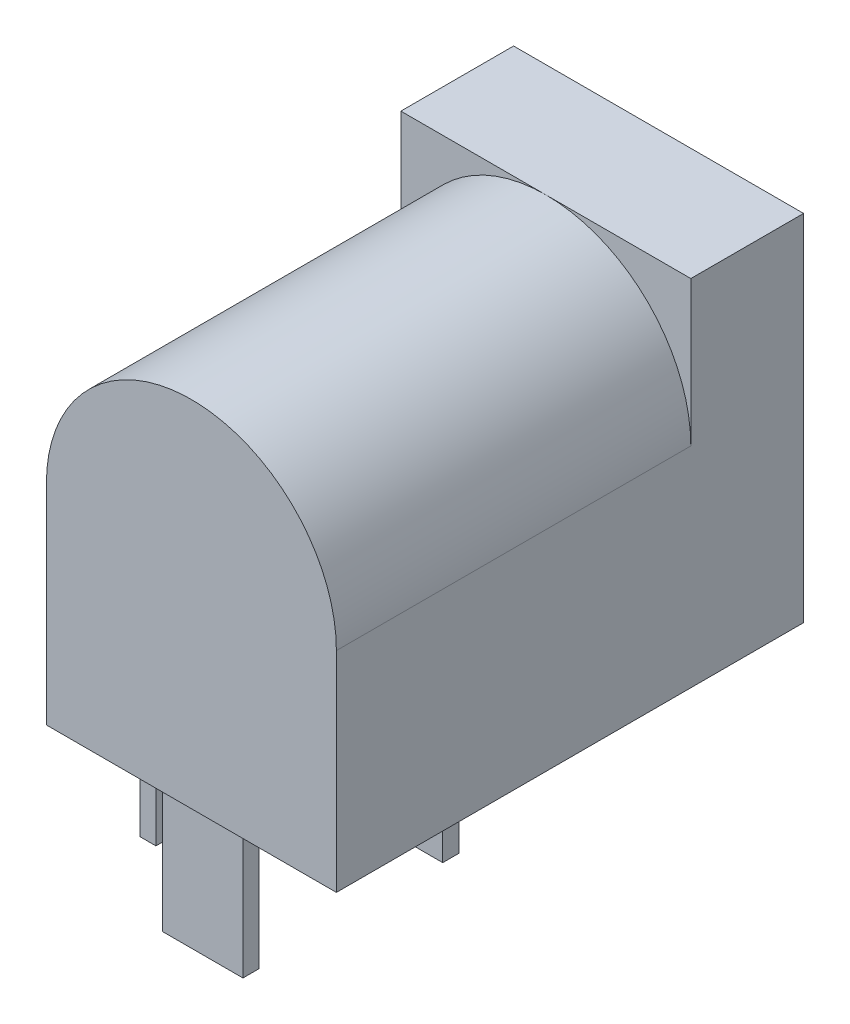
ISO-10303-21;
HEADER;
FILE_DESCRIPTION(('STEP AP214'),'2;1');
FILE_NAME('part.step','',(''),(''),'','','');
FILE_SCHEMA(('AUTOMOTIVE_DESIGN { 1 0 10303 214 1 1 1 1 }'));
ENDSEC;
DATA;
#1=APPLICATION_CONTEXT('core data for automotive mechanical design processes');
#2=APPLICATION_PROTOCOL_DEFINITION('international standard','automotive_design',2000,#1);
#3=PRODUCT_CONTEXT('',#1,'mechanical');
#4=PRODUCT('Part','Part','',(#3));
#5=PRODUCT_RELATED_PRODUCT_CATEGORY('part','',(#4));
#6=PRODUCT_DEFINITION_FORMATION('','',#4);
#7=PRODUCT_DEFINITION_CONTEXT('part definition',#1,'design');
#8=PRODUCT_DEFINITION('design','',#6,#7);
#9=PRODUCT_DEFINITION_SHAPE('','',#8);
#10=(LENGTH_UNIT() NAMED_UNIT(*) SI_UNIT(.MILLI.,.METRE.));
#11=(NAMED_UNIT(*) PLANE_ANGLE_UNIT() SI_UNIT($,.RADIAN.));
#12=(NAMED_UNIT(*) SI_UNIT($,.STERADIAN.) SOLID_ANGLE_UNIT());
#13=UNCERTAINTY_MEASURE_WITH_UNIT(LENGTH_MEASURE(1.E-05),#10,'distance_accuracy_value','');
#14=(GEOMETRIC_REPRESENTATION_CONTEXT(3) GLOBAL_UNCERTAINTY_ASSIGNED_CONTEXT((#13)) GLOBAL_UNIT_ASSIGNED_CONTEXT((#10,
#11,#12)) REPRESENTATION_CONTEXT('',''));
#15=CARTESIAN_POINT('',(0.,0.,0.));
#16=DIRECTION('',(0.,0.,1.));
#17=DIRECTION('',(1.,0.,0.));
#18=AXIS2_PLACEMENT_3D('',#15,#16,#17);
#19=CARTESIAN_POINT('',(-4.5,11.,14.5));
#20=DIRECTION('',(0.,-1.,0.));
#21=DIRECTION('',(1.,0.,0.));
#22=AXIS2_PLACEMENT_3D('',#19,#20,#21);
#23=PLANE('',#22);
#24=DIRECTION('',(-1.,0.,0.));
#25=VECTOR('',#24,1.);
#26=CARTESIAN_POINT('',(-4.5,11.,3.5));
#27=LINE('',#26,#25);
#28=CARTESIAN_POINT('',(4.5,11.,3.5));
#29=VERTEX_POINT('',#28);
#30=CARTESIAN_POINT('',(0.,11.,3.5));
#31=VERTEX_POINT('',#30);
#32=EDGE_CURVE('E11',#29,#31,#27,.T.);
#33=ORIENTED_EDGE('',*,*,#32,.F.);
#34=DIRECTION('',(0.,0.,-1.));
#35=VECTOR('',#34,1.);
#36=CARTESIAN_POINT('',(4.5,11.,14.5));
#37=LINE('',#36,#35);
#38=CARTESIAN_POINT('',(4.5,11.,0.));
#39=VERTEX_POINT('',#38);
#40=EDGE_CURVE('E179',#29,#39,#37,.T.);
#41=ORIENTED_EDGE('',*,*,#40,.T.);
#42=DIRECTION('',(-1.,0.,0.));
#43=VECTOR('',#42,1.);
#44=CARTESIAN_POINT('',(-4.5,11.,0.));
#45=LINE('',#44,#43);
#46=CARTESIAN_POINT('',(-4.5,11.,0.));
#47=VERTEX_POINT('',#46);
#48=EDGE_CURVE('E285',#39,#47,#45,.T.);
#49=ORIENTED_EDGE('',*,*,#48,.T.);
#50=DIRECTION('',(0.,0.,-1.));
#51=VECTOR('',#50,1.);
#52=CARTESIAN_POINT('',(-4.5,11.,14.5));
#53=LINE('',#52,#51);
#54=CARTESIAN_POINT('',(-4.5,11.,3.5));
#55=VERTEX_POINT('',#54);
#56=EDGE_CURVE('E289',#55,#47,#53,.T.);
#57=ORIENTED_EDGE('',*,*,#56,.F.);
#58=EDGE_CURVE('E35',#31,#55,#27,.T.);
#59=ORIENTED_EDGE('',*,*,#58,.F.);
#60=EDGE_LOOP('',(#33,#41,#49,#57,#59));
#61=FACE_BOUND('',#60,.T.);
#62=ADVANCED_FACE('F31',(#61),#23,.F.);
#63=CARTESIAN_POINT('',(-4.5,0.,14.5));
#64=DIRECTION('',(0.,1.,0.));
#65=DIRECTION('',(-1.,0.,0.));
#66=AXIS2_PLACEMENT_3D('',#63,#64,#65);
#67=PLANE('',#66);
#68=DIRECTION('',(0.,0.,-1.));
#69=VECTOR('',#68,1.);
#70=CARTESIAN_POINT('',(-1.25,0.,7.95));
#71=LINE('',#70,#69);
#72=CARTESIAN_POINT('',(-1.25,0.,7.95));
#73=VERTEX_POINT('',#72);
#74=CARTESIAN_POINT('',(-1.25,0.,7.45));
#75=VERTEX_POINT('',#74);
#76=EDGE_CURVE('E215',#73,#75,#71,.T.);
#77=ORIENTED_EDGE('',*,*,#76,.F.);
#78=DIRECTION('',(-1.,0.,0.));
#79=VECTOR('',#78,1.);
#80=CARTESIAN_POINT('',(-1.25,0.,7.95));
#81=LINE('',#80,#79);
#82=CARTESIAN_POINT('',(1.25,0.,7.95));
#83=VERTEX_POINT('',#82);
#84=EDGE_CURVE('E220',#83,#73,#81,.T.);
#85=ORIENTED_EDGE('',*,*,#84,.F.);
#86=DIRECTION('',(0.,0.,1.));
#87=VECTOR('',#86,1.);
#88=CARTESIAN_POINT('',(1.25,0.,7.95));
#89=LINE('',#88,#87);
#90=CARTESIAN_POINT('',(1.25,0.,7.45));
#91=VERTEX_POINT('',#90);
#92=EDGE_CURVE('E232',#91,#83,#89,.T.);
#93=ORIENTED_EDGE('',*,*,#92,.F.);
#94=DIRECTION('',(1.,0.,0.));
#95=VECTOR('',#94,1.);
#96=CARTESIAN_POINT('',(-1.25,0.,7.45));
#97=LINE('',#96,#95);
#98=EDGE_CURVE('E229',#75,#91,#97,.T.);
#99=ORIENTED_EDGE('',*,*,#98,.F.);
#100=EDGE_LOOP('',(#77,#85,#93,#99));
#101=FACE_BOUND('',#100,.T.);
#102=DIRECTION('',(1.,0.,0.));
#103=VECTOR('',#102,1.);
#104=CARTESIAN_POINT('',(-4.5,0.,0.));
#105=LINE('',#104,#103);
#106=CARTESIAN_POINT('',(-4.5,0.,0.));
#107=VERTEX_POINT('',#106);
#108=CARTESIAN_POINT('',(4.5,0.,0.));
#109=VERTEX_POINT('',#108);
#110=EDGE_CURVE('E292',#107,#109,#105,.T.);
#111=ORIENTED_EDGE('',*,*,#110,.T.);
#112=DIRECTION('',(0.,0.,-1.));
#113=VECTOR('',#112,1.);
#114=CARTESIAN_POINT('',(4.5,0.,14.5));
#115=LINE('',#114,#113);
#116=CARTESIAN_POINT('',(4.5,0.,14.5));
#117=VERTEX_POINT('',#116);
#118=EDGE_CURVE('E300',#117,#109,#115,.T.);
#119=ORIENTED_EDGE('',*,*,#118,.F.);
#120=DIRECTION('',(1.,0.,0.));
#121=VECTOR('',#120,1.);
#122=CARTESIAN_POINT('',(-4.5,0.,14.5));
#123=LINE('',#122,#121);
#124=CARTESIAN_POINT('',(-4.5,0.,14.5));
#125=VERTEX_POINT('',#124);
#126=EDGE_CURVE('E284',#125,#117,#123,.T.);
#127=ORIENTED_EDGE('',*,*,#126,.F.);
#128=DIRECTION('',(0.,0.,-1.));
#129=VECTOR('',#128,1.);
#130=CARTESIAN_POINT('',(-4.5,0.,14.5));
#131=LINE('',#130,#129);
#132=EDGE_CURVE('E303',#125,#107,#131,.T.);
#133=ORIENTED_EDGE('',*,*,#132,.T.);
#134=EDGE_LOOP('',(#111,#119,#127,#133));
#135=FACE_BOUND('',#134,.T.);
#136=DIRECTION('',(0.,0.,-1.));
#137=VECTOR('',#136,1.);
#138=CARTESIAN_POINT('',(-1.25,0.,13.65));
#139=LINE('',#138,#137);
#140=CARTESIAN_POINT('',(-1.25,0.,14.15));
#141=VERTEX_POINT('',#140);
#142=CARTESIAN_POINT('',(-1.25,0.,13.65));
#143=VERTEX_POINT('',#142);
#144=EDGE_CURVE('E248',#141,#143,#139,.T.);
#145=ORIENTED_EDGE('',*,*,#144,.F.);
#146=DIRECTION('',(-1.,0.,0.));
#147=VECTOR('',#146,1.);
#148=CARTESIAN_POINT('',(-1.25,0.,14.15));
#149=LINE('',#148,#147);
#150=CARTESIAN_POINT('',(1.25,0.,14.15));
#151=VERTEX_POINT('',#150);
#152=EDGE_CURVE('E253',#151,#141,#149,.T.);
#153=ORIENTED_EDGE('',*,*,#152,.F.);
#154=DIRECTION('',(0.,0.,1.));
#155=VECTOR('',#154,1.);
#156=CARTESIAN_POINT('',(1.25,0.,13.65));
#157=LINE('',#156,#155);
#158=CARTESIAN_POINT('',(1.25,0.,13.65));
#159=VERTEX_POINT('',#158);
#160=EDGE_CURVE('E265',#159,#151,#157,.T.);
#161=ORIENTED_EDGE('',*,*,#160,.F.);
#162=DIRECTION('',(1.,0.,0.));
#163=VECTOR('',#162,1.);
#164=CARTESIAN_POINT('',(-1.25,0.,13.65));
#165=LINE('',#164,#163);
#166=EDGE_CURVE('E262',#143,#159,#165,.T.);
#167=ORIENTED_EDGE('',*,*,#166,.F.);
#168=EDGE_LOOP('',(#145,#153,#161,#167));
#169=FACE_BOUND('',#168,.T.);
#170=DIRECTION('',(0.,0.,-1.));
#171=VECTOR('',#170,1.);
#172=CARTESIAN_POINT('',(-4.15,0.,11.95));
#173=LINE('',#172,#171);
#174=CARTESIAN_POINT('',(-4.15,0.,11.95));
#175=VERTEX_POINT('',#174);
#176=CARTESIAN_POINT('',(-4.15,0.,9.45));
#177=VERTEX_POINT('',#176);
#178=EDGE_CURVE('E182',#175,#177,#173,.T.);
#179=ORIENTED_EDGE('',*,*,#178,.F.);
#180=DIRECTION('',(-1.,0.,0.));
#181=VECTOR('',#180,1.);
#182=CARTESIAN_POINT('',(-4.15,0.,11.95));
#183=LINE('',#182,#181);
#184=CARTESIAN_POINT('',(-3.65,0.,11.95));
#185=VERTEX_POINT('',#184);
#186=EDGE_CURVE('E190',#185,#175,#183,.T.);
#187=ORIENTED_EDGE('',*,*,#186,.F.);
#188=DIRECTION('',(0.,0.,1.));
#189=VECTOR('',#188,1.);
#190=CARTESIAN_POINT('',(-3.65,0.,11.95));
#191=LINE('',#190,#189);
#192=CARTESIAN_POINT('',(-3.65,0.,9.45));
#193=VERTEX_POINT('',#192);
#194=EDGE_CURVE('E200',#193,#185,#191,.T.);
#195=ORIENTED_EDGE('',*,*,#194,.F.);
#196=DIRECTION('',(1.,0.,0.));
#197=VECTOR('',#196,1.);
#198=CARTESIAN_POINT('',(-4.15,0.,9.45));
#199=LINE('',#198,#197);
#200=EDGE_CURVE('E54',#177,#193,#199,.T.);
#201=ORIENTED_EDGE('',*,*,#200,.F.);
#202=EDGE_LOOP('',(#179,#187,#195,#201));
#203=FACE_BOUND('',#202,.T.);
#204=ADVANCED_FACE('F322',(#101,#135,#169,#203),#67,.F.);
#205=CARTESIAN_POINT('',(-4.5,0.,14.5));
#206=DIRECTION('',(1.,0.,0.));
#207=DIRECTION('',(0.,0.,-1.));
#208=AXIS2_PLACEMENT_3D('',#205,#206,#207);
#209=PLANE('',#208);
#210=DIRECTION('',(0.,-1.,0.));
#211=VECTOR('',#210,1.);
#212=CARTESIAN_POINT('',(-4.5,0.,14.5));
#213=LINE('',#212,#211);
#214=CARTESIAN_POINT('',(-4.5,6.5,14.5));
#215=VERTEX_POINT('',#214);
#216=EDGE_CURVE('E282',#215,#125,#213,.T.);
#217=ORIENTED_EDGE('',*,*,#216,.F.);
#218=DIRECTION('',(0.,0.,1.));
#219=VECTOR('',#218,1.);
#220=CARTESIAN_POINT('',(-4.5,6.5,3.5));
#221=LINE('',#220,#219);
#222=CARTESIAN_POINT('',(-4.5,6.5,3.5));
#223=VERTEX_POINT('',#222);
#224=EDGE_CURVE('E174',#223,#215,#221,.T.);
#225=ORIENTED_EDGE('',*,*,#224,.F.);
#226=DIRECTION('',(0.,-1.,0.));
#227=VECTOR('',#226,1.);
#228=CARTESIAN_POINT('',(-4.5,0.,3.5));
#229=LINE('',#228,#227);
#230=EDGE_CURVE('E180',#55,#223,#229,.T.);
#231=ORIENTED_EDGE('',*,*,#230,.F.);
#232=ORIENTED_EDGE('',*,*,#56,.T.);
#233=DIRECTION('',(0.,-1.,0.));
#234=VECTOR('',#233,1.);
#235=CARTESIAN_POINT('',(-4.5,0.,0.));
#236=LINE('',#235,#234);
#237=EDGE_CURVE('E281',#47,#107,#236,.T.);
#238=ORIENTED_EDGE('',*,*,#237,.T.);
#239=ORIENTED_EDGE('',*,*,#132,.F.);
#240=EDGE_LOOP('',(#217,#225,#231,#232,#238,#239));
#241=FACE_BOUND('',#240,.T.);
#242=ADVANCED_FACE('F33',(#241),#209,.F.);
#243=CARTESIAN_POINT('',(4.5,0.,14.5));
#244=DIRECTION('',(-1.,0.,0.));
#245=DIRECTION('',(0.,-1.,0.));
#246=AXIS2_PLACEMENT_3D('',#243,#244,#245);
#247=PLANE('',#246);
#248=DIRECTION('',(0.,1.,0.));
#249=VECTOR('',#248,1.);
#250=CARTESIAN_POINT('',(4.5,0.,3.5));
#251=LINE('',#250,#249);
#252=CARTESIAN_POINT('',(4.5,6.5,3.5));
#253=VERTEX_POINT('',#252);
#254=EDGE_CURVE('E161',#253,#29,#251,.T.);
#255=ORIENTED_EDGE('',*,*,#254,.F.);
#256=DIRECTION('',(0.,0.,1.));
#257=VECTOR('',#256,1.);
#258=CARTESIAN_POINT('',(4.5,6.5,3.5));
#259=LINE('',#258,#257);
#260=CARTESIAN_POINT('',(4.5,6.5,14.5));
#261=VERTEX_POINT('',#260);
#262=EDGE_CURVE('E170',#253,#261,#259,.T.);
#263=ORIENTED_EDGE('',*,*,#262,.T.);
#264=DIRECTION('',(0.,1.,0.));
#265=VECTOR('',#264,1.);
#266=CARTESIAN_POINT('',(4.5,0.,14.5));
#267=LINE('',#266,#265);
#268=EDGE_CURVE('E287',#117,#261,#267,.T.);
#269=ORIENTED_EDGE('',*,*,#268,.F.);
#270=ORIENTED_EDGE('',*,*,#118,.T.);
#271=DIRECTION('',(0.,1.,0.));
#272=VECTOR('',#271,1.);
#273=CARTESIAN_POINT('',(4.5,0.,0.));
#274=LINE('',#273,#272);
#275=EDGE_CURVE('E294',#109,#39,#274,.T.);
#276=ORIENTED_EDGE('',*,*,#275,.T.);
#277=ORIENTED_EDGE('',*,*,#40,.F.);
#278=EDGE_LOOP('',(#255,#263,#269,#270,#276,#277));
#279=FACE_BOUND('',#278,.T.);
#280=ADVANCED_FACE('F177',(#279),#247,.F.);
#281=CARTESIAN_POINT('',(-4.5,0.,14.5));
#282=DIRECTION('',(0.,0.,-1.));
#283=DIRECTION('',(-1.,0.,0.));
#284=AXIS2_PLACEMENT_3D('',#281,#282,#283);
#285=PLANE('',#284);
#286=ORIENTED_EDGE('',*,*,#268,.T.);
#287=CARTESIAN_POINT('',(0.,6.5,14.5));
#288=DIRECTION('',(0.,0.,-1.));
#289=DIRECTION('',(-1.,0.,0.));
#290=AXIS2_PLACEMENT_3D('',#287,#288,#289);
#291=CIRCLE('',#290,4.5);
#292=EDGE_CURVE('E46',#261,#215,#291,.F.);
#293=ORIENTED_EDGE('',*,*,#292,.T.);
#294=ORIENTED_EDGE('',*,*,#216,.T.);
#295=ORIENTED_EDGE('',*,*,#126,.T.);
#296=EDGE_LOOP('',(#286,#293,#294,#295));
#297=FACE_BOUND('',#296,.T.);
#298=ADVANCED_FACE('F325',(#297),#285,.F.);
#299=CARTESIAN_POINT('',(-4.5,0.,0.));
#300=DIRECTION('',(0.,0.,-1.));
#301=DIRECTION('',(-1.,0.,0.));
#302=AXIS2_PLACEMENT_3D('',#299,#300,#301);
#303=PLANE('',#302);
#304=CARTESIAN_POINT('',(0.,6.5,0.));
#305=DIRECTION('',(0.,0.,-1.));
#306=DIRECTION('',(-1.,0.,0.));
#307=AXIS2_PLACEMENT_3D('',#304,#305,#306);
#308=CIRCLE('',#307,2.1);
#309=CARTESIAN_POINT('',(-2.1,6.5,0.));
#310=VERTEX_POINT('',#309);
#311=EDGE_CURVE('E541',#310,#310,#308,.T.);
#312=ORIENTED_EDGE('',*,*,#311,.F.);
#313=EDGE_LOOP('',(#312));
#314=FACE_BOUND('',#313,.T.);
#315=ORIENTED_EDGE('',*,*,#237,.F.);
#316=ORIENTED_EDGE('',*,*,#48,.F.);
#317=ORIENTED_EDGE('',*,*,#275,.F.);
#318=ORIENTED_EDGE('',*,*,#110,.F.);
#319=EDGE_LOOP('',(#315,#316,#317,#318));
#320=FACE_BOUND('',#319,.T.);
#321=ADVANCED_FACE('F318',(#314,#320),#303,.T.);
#322=CARTESIAN_POINT('',(-1.25,-4.1,13.65));
#323=DIRECTION('',(1.,0.,0.));
#324=DIRECTION('',(0.,0.,-1.));
#325=AXIS2_PLACEMENT_3D('',#322,#323,#324);
#326=PLANE('',#325);
#327=ORIENTED_EDGE('',*,*,#144,.T.);
#328=DIRECTION('',(0.,1.,0.));
#329=VECTOR('',#328,1.);
#330=CARTESIAN_POINT('',(-1.25,-4.1,13.65));
#331=LINE('',#330,#329);
#332=CARTESIAN_POINT('',(-1.25,-4.1,13.65));
#333=VERTEX_POINT('',#332);
#334=EDGE_CURVE('E278',#333,#143,#331,.T.);
#335=ORIENTED_EDGE('',*,*,#334,.F.);
#336=DIRECTION('',(0.,0.,-1.));
#337=VECTOR('',#336,1.);
#338=CARTESIAN_POINT('',(-1.25,-4.1,13.65));
#339=LINE('',#338,#337);
#340=CARTESIAN_POINT('',(-1.25,-4.1,14.15));
#341=VERTEX_POINT('',#340);
#342=EDGE_CURVE('E249',#341,#333,#339,.T.);
#343=ORIENTED_EDGE('',*,*,#342,.F.);
#344=DIRECTION('',(0.,1.,0.));
#345=VECTOR('',#344,1.);
#346=CARTESIAN_POINT('',(-1.25,-4.1,14.15));
#347=LINE('',#346,#345);
#348=EDGE_CURVE('E259',#341,#141,#347,.T.);
#349=ORIENTED_EDGE('',*,*,#348,.T.);
#350=EDGE_LOOP('',(#327,#335,#343,#349));
#351=FACE_BOUND('',#350,.T.);
#352=ADVANCED_FACE('F332',(#351),#326,.F.);
#353=CARTESIAN_POINT('',(-1.25,-4.1,13.65));
#354=DIRECTION('',(0.,0.,1.));
#355=DIRECTION('',(1.,0.,0.));
#356=AXIS2_PLACEMENT_3D('',#353,#354,#355);
#357=PLANE('',#356);
#358=ORIENTED_EDGE('',*,*,#166,.T.);
#359=DIRECTION('',(0.,1.,0.));
#360=VECTOR('',#359,1.);
#361=CARTESIAN_POINT('',(1.25,-4.1,13.65));
#362=LINE('',#361,#360);
#363=CARTESIAN_POINT('',(1.25,-4.1,13.65));
#364=VERTEX_POINT('',#363);
#365=EDGE_CURVE('E275',#364,#159,#362,.T.);
#366=ORIENTED_EDGE('',*,*,#365,.F.);
#367=DIRECTION('',(1.,0.,0.));
#368=VECTOR('',#367,1.);
#369=CARTESIAN_POINT('',(-1.25,-4.1,13.65));
#370=LINE('',#369,#368);
#371=EDGE_CURVE('E252',#333,#364,#370,.T.);
#372=ORIENTED_EDGE('',*,*,#371,.F.);
#373=ORIENTED_EDGE('',*,*,#334,.T.);
#374=EDGE_LOOP('',(#358,#366,#372,#373));
#375=FACE_BOUND('',#374,.T.);
#376=ADVANCED_FACE('F384',(#375),#357,.F.);
#377=CARTESIAN_POINT('',(1.25,-4.1,13.65));
#378=DIRECTION('',(-1.,0.,0.));
#379=DIRECTION('',(0.,0.,1.));
#380=AXIS2_PLACEMENT_3D('',#377,#378,#379);
#381=PLANE('',#380);
#382=ORIENTED_EDGE('',*,*,#160,.T.);
#383=DIRECTION('',(0.,1.,0.));
#384=VECTOR('',#383,1.);
#385=CARTESIAN_POINT('',(1.25,-4.1,14.15));
#386=LINE('',#385,#384);
#387=CARTESIAN_POINT('',(1.25,-4.1,14.15));
#388=VERTEX_POINT('',#387);
#389=EDGE_CURVE('E272',#388,#151,#386,.T.);
#390=ORIENTED_EDGE('',*,*,#389,.F.);
#391=DIRECTION('',(0.,0.,1.));
#392=VECTOR('',#391,1.);
#393=CARTESIAN_POINT('',(1.25,-4.1,13.65));
#394=LINE('',#393,#392);
#395=EDGE_CURVE('E255',#364,#388,#394,.T.);
#396=ORIENTED_EDGE('',*,*,#395,.F.);
#397=ORIENTED_EDGE('',*,*,#365,.T.);
#398=EDGE_LOOP('',(#382,#390,#396,#397));
#399=FACE_BOUND('',#398,.T.);
#400=ADVANCED_FACE('F380',(#399),#381,.F.);
#401=CARTESIAN_POINT('',(-1.25,-4.1,14.15));
#402=DIRECTION('',(0.,0.,-1.));
#403=DIRECTION('',(-1.,0.,0.));
#404=AXIS2_PLACEMENT_3D('',#401,#402,#403);
#405=PLANE('',#404);
#406=ORIENTED_EDGE('',*,*,#152,.T.);
#407=ORIENTED_EDGE('',*,*,#348,.F.);
#408=DIRECTION('',(-1.,0.,0.));
#409=VECTOR('',#408,1.);
#410=CARTESIAN_POINT('',(-1.25,-4.1,14.15));
#411=LINE('',#410,#409);
#412=EDGE_CURVE('E257',#388,#341,#411,.T.);
#413=ORIENTED_EDGE('',*,*,#412,.F.);
#414=ORIENTED_EDGE('',*,*,#389,.T.);
#415=EDGE_LOOP('',(#406,#407,#413,#414));
#416=FACE_BOUND('',#415,.T.);
#417=ADVANCED_FACE('F376',(#416),#405,.F.);
#418=CARTESIAN_POINT('',(-1.25,-4.1,14.15));
#419=DIRECTION('',(0.,1.,0.));
#420=DIRECTION('',(-1.,0.,0.));
#421=AXIS2_PLACEMENT_3D('',#418,#419,#420);
#422=PLANE('',#421);
#423=ORIENTED_EDGE('',*,*,#342,.T.);
#424=ORIENTED_EDGE('',*,*,#371,.T.);
#425=ORIENTED_EDGE('',*,*,#395,.T.);
#426=ORIENTED_EDGE('',*,*,#412,.T.);
#427=EDGE_LOOP('',(#423,#424,#425,#426));
#428=FACE_BOUND('',#427,.T.);
#429=ADVANCED_FACE('F370',(#428),#422,.F.);
#430=CARTESIAN_POINT('',(-1.25,-4.1,7.95));
#431=DIRECTION('',(1.,0.,0.));
#432=DIRECTION('',(0.,1.,0.));
#433=AXIS2_PLACEMENT_3D('',#430,#431,#432);
#434=PLANE('',#433);
#435=ORIENTED_EDGE('',*,*,#76,.T.);
#436=DIRECTION('',(0.,1.,0.));
#437=VECTOR('',#436,1.);
#438=CARTESIAN_POINT('',(-1.25,-4.1,7.45));
#439=LINE('',#438,#437);
#440=CARTESIAN_POINT('',(-1.25,-4.1,7.45));
#441=VERTEX_POINT('',#440);
#442=EDGE_CURVE('E245',#441,#75,#439,.T.);
#443=ORIENTED_EDGE('',*,*,#442,.F.);
#444=DIRECTION('',(0.,0.,-1.));
#445=VECTOR('',#444,1.);
#446=CARTESIAN_POINT('',(-1.25,-4.1,7.95));
#447=LINE('',#446,#445);
#448=CARTESIAN_POINT('',(-1.25,-4.1,7.95));
#449=VERTEX_POINT('',#448);
#450=EDGE_CURVE('E216',#449,#441,#447,.T.);
#451=ORIENTED_EDGE('',*,*,#450,.F.);
#452=DIRECTION('',(0.,1.,0.));
#453=VECTOR('',#452,1.);
#454=CARTESIAN_POINT('',(-1.25,-4.1,7.95));
#455=LINE('',#454,#453);
#456=EDGE_CURVE('E226',#449,#73,#455,.T.);
#457=ORIENTED_EDGE('',*,*,#456,.T.);
#458=EDGE_LOOP('',(#435,#443,#451,#457));
#459=FACE_BOUND('',#458,.T.);
#460=ADVANCED_FACE('F354',(#459),#434,.F.);
#461=CARTESIAN_POINT('',(-1.25,-4.1,7.45));
#462=DIRECTION('',(0.,0.,1.));
#463=DIRECTION('',(1.,0.,0.));
#464=AXIS2_PLACEMENT_3D('',#461,#462,#463);
#465=PLANE('',#464);
#466=ORIENTED_EDGE('',*,*,#98,.T.);
#467=DIRECTION('',(0.,1.,0.));
#468=VECTOR('',#467,1.);
#469=CARTESIAN_POINT('',(1.25,-4.1,7.45));
#470=LINE('',#469,#468);
#471=CARTESIAN_POINT('',(1.25,-4.1,7.45));
#472=VERTEX_POINT('',#471);
#473=EDGE_CURVE('E242',#472,#91,#470,.T.);
#474=ORIENTED_EDGE('',*,*,#473,.F.);
#475=DIRECTION('',(1.,0.,0.));
#476=VECTOR('',#475,1.);
#477=CARTESIAN_POINT('',(-1.25,-4.1,7.45));
#478=LINE('',#477,#476);
#479=EDGE_CURVE('E219',#441,#472,#478,.T.);
#480=ORIENTED_EDGE('',*,*,#479,.F.);
#481=ORIENTED_EDGE('',*,*,#442,.T.);
#482=EDGE_LOOP('',(#466,#474,#480,#481));
#483=FACE_BOUND('',#482,.T.);
#484=ADVANCED_FACE('F362',(#483),#465,.F.);
#485=CARTESIAN_POINT('',(1.25,-4.1,7.95));
#486=DIRECTION('',(-1.,0.,0.));
#487=DIRECTION('',(0.,-1.,0.));
#488=AXIS2_PLACEMENT_3D('',#485,#486,#487);
#489=PLANE('',#488);
#490=ORIENTED_EDGE('',*,*,#92,.T.);
#491=DIRECTION('',(0.,1.,0.));
#492=VECTOR('',#491,1.);
#493=CARTESIAN_POINT('',(1.25,-4.1,7.95));
#494=LINE('',#493,#492);
#495=CARTESIAN_POINT('',(1.25,-4.1,7.95));
#496=VERTEX_POINT('',#495);
#497=EDGE_CURVE('E239',#496,#83,#494,.T.);
#498=ORIENTED_EDGE('',*,*,#497,.F.);
#499=DIRECTION('',(0.,0.,1.));
#500=VECTOR('',#499,1.);
#501=CARTESIAN_POINT('',(1.25,-4.1,7.95));
#502=LINE('',#501,#500);
#503=EDGE_CURVE('E222',#472,#496,#502,.T.);
#504=ORIENTED_EDGE('',*,*,#503,.F.);
#505=ORIENTED_EDGE('',*,*,#473,.T.);
#506=EDGE_LOOP('',(#490,#498,#504,#505));
#507=FACE_BOUND('',#506,.T.);
#508=ADVANCED_FACE('F360',(#507),#489,.F.);
#509=CARTESIAN_POINT('',(-1.25,-4.1,7.95));
#510=DIRECTION('',(0.,0.,-1.));
#511=DIRECTION('',(-1.,0.,0.));
#512=AXIS2_PLACEMENT_3D('',#509,#510,#511);
#513=PLANE('',#512);
#514=ORIENTED_EDGE('',*,*,#84,.T.);
#515=ORIENTED_EDGE('',*,*,#456,.F.);
#516=DIRECTION('',(-1.,0.,0.));
#517=VECTOR('',#516,1.);
#518=CARTESIAN_POINT('',(-1.25,-4.1,7.95));
#519=LINE('',#518,#517);
#520=EDGE_CURVE('E224',#496,#449,#519,.T.);
#521=ORIENTED_EDGE('',*,*,#520,.F.);
#522=ORIENTED_EDGE('',*,*,#497,.T.);
#523=EDGE_LOOP('',(#514,#515,#521,#522));
#524=FACE_BOUND('',#523,.T.);
#525=ADVANCED_FACE('F350',(#524),#513,.F.);
#526=CARTESIAN_POINT('',(-1.25,-4.1,7.45));
#527=DIRECTION('',(0.,-1.,0.));
#528=DIRECTION('',(1.,0.,0.));
#529=AXIS2_PLACEMENT_3D('',#526,#527,#528);
#530=PLANE('',#529);
#531=ORIENTED_EDGE('',*,*,#450,.T.);
#532=ORIENTED_EDGE('',*,*,#479,.T.);
#533=ORIENTED_EDGE('',*,*,#503,.T.);
#534=ORIENTED_EDGE('',*,*,#520,.T.);
#535=EDGE_LOOP('',(#531,#532,#533,#534));
#536=FACE_BOUND('',#535,.T.);
#537=ADVANCED_FACE('F356',(#536),#530,.T.);
#538=CARTESIAN_POINT('',(-4.15,-4.1,11.95));
#539=DIRECTION('',(1.,0.,0.));
#540=DIRECTION('',(0.,1.,0.));
#541=AXIS2_PLACEMENT_3D('',#538,#539,#540);
#542=PLANE('',#541);
#543=ORIENTED_EDGE('',*,*,#178,.T.);
#544=DIRECTION('',(0.,1.,0.));
#545=VECTOR('',#544,1.);
#546=CARTESIAN_POINT('',(-4.15,-4.1,9.45));
#547=LINE('',#546,#545);
#548=CARTESIAN_POINT('',(-4.15,-4.1,9.45));
#549=VERTEX_POINT('',#548);
#550=EDGE_CURVE('E213',#549,#177,#547,.T.);
#551=ORIENTED_EDGE('',*,*,#550,.F.);
#552=DIRECTION('',(0.,0.,-1.));
#553=VECTOR('',#552,1.);
#554=CARTESIAN_POINT('',(-4.15,-4.1,11.95));
#555=LINE('',#554,#553);
#556=CARTESIAN_POINT('',(-4.15,-4.1,11.95));
#557=VERTEX_POINT('',#556);
#558=EDGE_CURVE('E186',#557,#549,#555,.T.);
#559=ORIENTED_EDGE('',*,*,#558,.F.);
#560=DIRECTION('',(0.,1.,0.));
#561=VECTOR('',#560,1.);
#562=CARTESIAN_POINT('',(-4.15,-4.1,11.95));
#563=LINE('',#562,#561);
#564=EDGE_CURVE('E196',#557,#175,#563,.T.);
#565=ORIENTED_EDGE('',*,*,#564,.T.);
#566=EDGE_LOOP('',(#543,#551,#559,#565));
#567=FACE_BOUND('',#566,.T.);
#568=ADVANCED_FACE('F407',(#567),#542,.F.);
#569=CARTESIAN_POINT('',(-4.15,-4.1,9.45));
#570=DIRECTION('',(0.,0.,1.));
#571=DIRECTION('',(1.,0.,0.));
#572=AXIS2_PLACEMENT_3D('',#569,#570,#571);
#573=PLANE('',#572);
#574=ORIENTED_EDGE('',*,*,#200,.T.);
#575=DIRECTION('',(0.,1.,0.));
#576=VECTOR('',#575,1.);
#577=CARTESIAN_POINT('',(-3.65,-4.1,9.45));
#578=LINE('',#577,#576);
#579=CARTESIAN_POINT('',(-3.65,-4.1,9.45));
#580=VERTEX_POINT('',#579);
#581=EDGE_CURVE('E210',#580,#193,#578,.T.);
#582=ORIENTED_EDGE('',*,*,#581,.F.);
#583=DIRECTION('',(1.,0.,0.));
#584=VECTOR('',#583,1.);
#585=CARTESIAN_POINT('',(-4.15,-4.1,9.45));
#586=LINE('',#585,#584);
#587=EDGE_CURVE('E189',#549,#580,#586,.T.);
#588=ORIENTED_EDGE('',*,*,#587,.F.);
#589=ORIENTED_EDGE('',*,*,#550,.T.);
#590=EDGE_LOOP('',(#574,#582,#588,#589));
#591=FACE_BOUND('',#590,.T.);
#592=ADVANCED_FACE('F415',(#591),#573,.F.);
#593=CARTESIAN_POINT('',(-3.65,-4.1,11.95));
#594=DIRECTION('',(-1.,0.,0.));
#595=DIRECTION('',(0.,-1.,0.));
#596=AXIS2_PLACEMENT_3D('',#593,#594,#595);
#597=PLANE('',#596);
#598=ORIENTED_EDGE('',*,*,#194,.T.);
#599=DIRECTION('',(0.,1.,0.));
#600=VECTOR('',#599,1.);
#601=CARTESIAN_POINT('',(-3.65,-4.1,11.95));
#602=LINE('',#601,#600);
#603=CARTESIAN_POINT('',(-3.65,-4.1,11.95));
#604=VERTEX_POINT('',#603);
#605=EDGE_CURVE('E207',#604,#185,#602,.T.);
#606=ORIENTED_EDGE('',*,*,#605,.F.);
#607=DIRECTION('',(0.,0.,1.));
#608=VECTOR('',#607,1.);
#609=CARTESIAN_POINT('',(-3.65,-4.1,11.95));
#610=LINE('',#609,#608);
#611=EDGE_CURVE('E192',#580,#604,#610,.T.);
#612=ORIENTED_EDGE('',*,*,#611,.F.);
#613=ORIENTED_EDGE('',*,*,#581,.T.);
#614=EDGE_LOOP('',(#598,#606,#612,#613));
#615=FACE_BOUND('',#614,.T.);
#616=ADVANCED_FACE('F413',(#615),#597,.F.);
#617=CARTESIAN_POINT('',(-4.15,-4.1,11.95));
#618=DIRECTION('',(0.,0.,-1.));
#619=DIRECTION('',(-1.,0.,0.));
#620=AXIS2_PLACEMENT_3D('',#617,#618,#619);
#621=PLANE('',#620);
#622=ORIENTED_EDGE('',*,*,#186,.T.);
#623=ORIENTED_EDGE('',*,*,#564,.F.);
#624=DIRECTION('',(-1.,0.,0.));
#625=VECTOR('',#624,1.);
#626=CARTESIAN_POINT('',(-4.15,-4.1,11.95));
#627=LINE('',#626,#625);
#628=EDGE_CURVE('E194',#604,#557,#627,.T.);
#629=ORIENTED_EDGE('',*,*,#628,.F.);
#630=ORIENTED_EDGE('',*,*,#605,.T.);
#631=EDGE_LOOP('',(#622,#623,#629,#630));
#632=FACE_BOUND('',#631,.T.);
#633=ADVANCED_FACE('F403',(#632),#621,.F.);
#634=CARTESIAN_POINT('',(-4.15,-4.1,9.45));
#635=DIRECTION('',(0.,-1.,0.));
#636=DIRECTION('',(1.,0.,0.));
#637=AXIS2_PLACEMENT_3D('',#634,#635,#636);
#638=PLANE('',#637);
#639=ORIENTED_EDGE('',*,*,#558,.T.);
#640=ORIENTED_EDGE('',*,*,#587,.T.);
#641=ORIENTED_EDGE('',*,*,#611,.T.);
#642=ORIENTED_EDGE('',*,*,#628,.T.);
#643=EDGE_LOOP('',(#639,#640,#641,#642));
#644=FACE_BOUND('',#643,.T.);
#645=ADVANCED_FACE('F409',(#644),#638,.T.);
#646=CARTESIAN_POINT('',(0.,6.5,3.5));
#647=DIRECTION('',(0.,0.,1.));
#648=DIRECTION('',(1.,0.,0.));
#649=AXIS2_PLACEMENT_3D('',#646,#647,#648);
#650=PLANE('',#649);
#651=ORIENTED_EDGE('',*,*,#230,.T.);
#652=CARTESIAN_POINT('',(0.,6.5,3.5));
#653=DIRECTION('',(0.,0.,-1.));
#654=DIRECTION('',(1.,0.,0.));
#655=AXIS2_PLACEMENT_3D('',#652,#653,#654);
#656=CIRCLE('',#655,4.5);
#657=EDGE_CURVE('E166',#223,#31,#656,.T.);
#658=ORIENTED_EDGE('',*,*,#657,.T.);
#659=ORIENTED_EDGE('',*,*,#58,.T.);
#660=EDGE_LOOP('',(#651,#658,#659));
#661=FACE_BOUND('',#660,.T.);
#662=ADVANCED_FACE('F308',(#661),#650,.T.);
#663=ORIENTED_EDGE('',*,*,#254,.T.);
#664=ORIENTED_EDGE('',*,*,#32,.T.);
#665=EDGE_CURVE('E157',#31,#253,#656,.T.);
#666=ORIENTED_EDGE('',*,*,#665,.T.);
#667=EDGE_LOOP('',(#663,#664,#666));
#668=FACE_BOUND('',#667,.T.);
#669=ADVANCED_FACE('F159',(#668),#650,.T.);
#670=CARTESIAN_POINT('',(0.,6.5,3.5));
#671=DIRECTION('',(0.,0.,1.));
#672=DIRECTION('',(1.,0.,0.));
#673=AXIS2_PLACEMENT_3D('',#670,#671,#672);
#674=CYLINDRICAL_SURFACE('',#673,4.5);
#675=ORIENTED_EDGE('',*,*,#292,.F.);
#676=ORIENTED_EDGE('',*,*,#262,.F.);
#677=ORIENTED_EDGE('',*,*,#665,.F.);
#678=ORIENTED_EDGE('',*,*,#657,.F.);
#679=ORIENTED_EDGE('',*,*,#224,.T.);
#680=EDGE_LOOP('',(#675,#676,#677,#678,#679));
#681=FACE_BOUND('',#680,.T.);
#682=ADVANCED_FACE('F171',(#681),#674,.T.);
#683=CARTESIAN_POINT('',(0.,6.5,10.));
#684=DIRECTION('',(0.,0.,-1.));
#685=DIRECTION('',(-1.,0.,0.));
#686=AXIS2_PLACEMENT_3D('',#683,#684,#685);
#687=CYLINDRICAL_SURFACE('',#686,2.1);
#688=CARTESIAN_POINT('',(0.,6.5,10.));
#689=DIRECTION('',(0.,0.,-1.));
#690=DIRECTION('',(-1.,0.,0.));
#691=AXIS2_PLACEMENT_3D('',#688,#689,#690);
#692=CIRCLE('',#691,2.1);
#693=CARTESIAN_POINT('',(-2.1,6.5,10.));
#694=VERTEX_POINT('',#693);
#695=EDGE_CURVE('E167',#694,#694,#692,.T.);
#696=ORIENTED_EDGE('',*,*,#695,.F.);
#697=EDGE_LOOP('',(#696));
#698=FACE_BOUND('',#697,.T.);
#699=ORIENTED_EDGE('',*,*,#311,.T.);
#700=EDGE_LOOP('',(#699));
#701=FACE_BOUND('',#700,.T.);
#702=ADVANCED_FACE('F510',(#698,#701),#687,.F.);
#703=CARTESIAN_POINT('',(0.,6.5,10.));
#704=DIRECTION('',(0.,0.,-1.));
#705=DIRECTION('',(-1.,0.,0.));
#706=AXIS2_PLACEMENT_3D('',#703,#704,#705);
#707=PLANE('',#706);
#708=ORIENTED_EDGE('',*,*,#695,.T.);
#709=EDGE_LOOP('',(#708));
#710=FACE_BOUND('',#709,.T.);
#711=ADVANCED_FACE('F525',(#710),#707,.T.);
#712=CLOSED_SHELL('',(#62,#204,#242,#280,#298,#321,#352,#376,#400,#417,#429,#460,#484,#508,#525,
#537,#568,#592,#616,#633,#645,#662,#669,#682,#702,#711));
#713=MANIFOLD_SOLID_BREP('B2',#712);
#714=ADVANCED_BREP_SHAPE_REPRESENTATION('',(#18,#713),#14);
#715=SHAPE_DEFINITION_REPRESENTATION(#9,#714);
ENDSEC;
END-ISO-10303-21;
